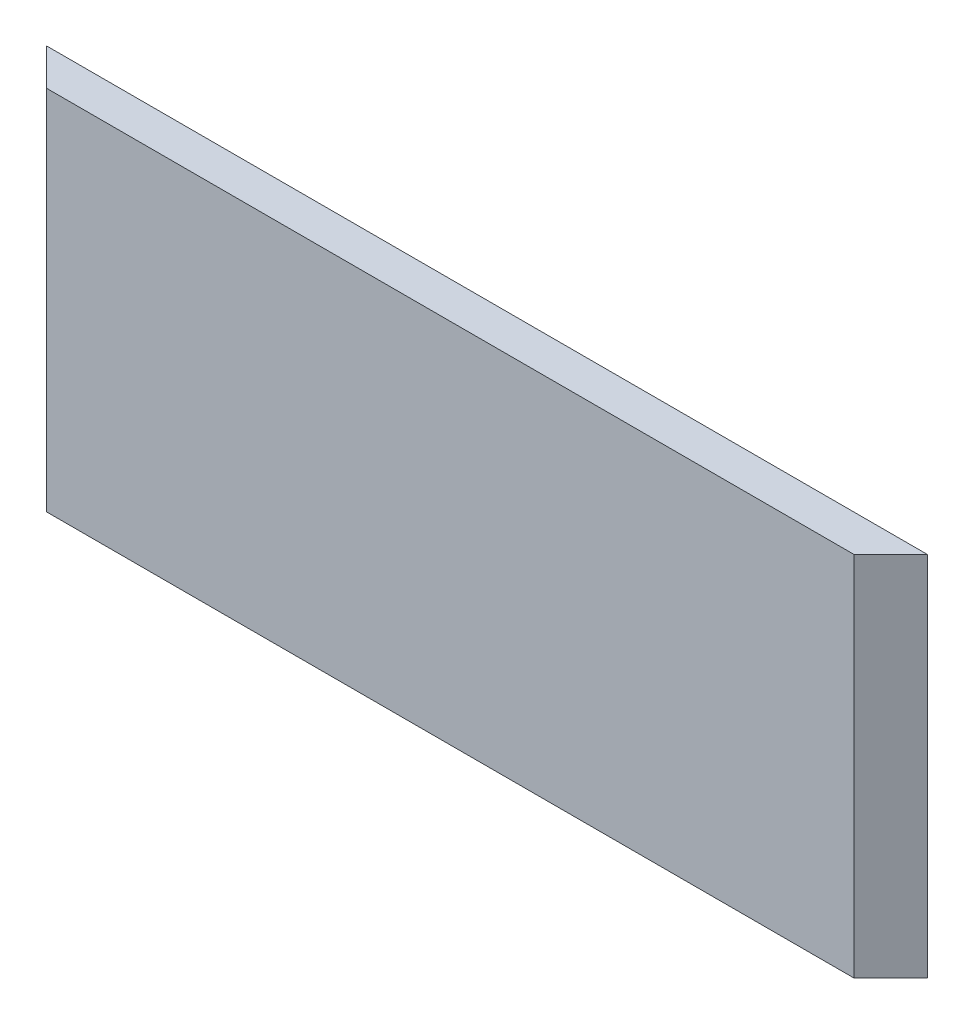
ISO-10303-21;
HEADER;
FILE_DESCRIPTION(('STEP AP214'),'2;1');
FILE_NAME('part.step','',(''),(''),'','','');
FILE_SCHEMA(('AUTOMOTIVE_DESIGN { 1 0 10303 214 1 1 1 1 }'));
ENDSEC;
DATA;
#1=APPLICATION_CONTEXT('core data for automotive mechanical design processes');
#2=APPLICATION_PROTOCOL_DEFINITION('international standard','automotive_design',2000,#1);
#3=PRODUCT_CONTEXT('',#1,'mechanical');
#4=PRODUCT('Part','Part','',(#3));
#5=PRODUCT_RELATED_PRODUCT_CATEGORY('part','',(#4));
#6=PRODUCT_DEFINITION_FORMATION('','',#4);
#7=PRODUCT_DEFINITION_CONTEXT('part definition',#1,'design');
#8=PRODUCT_DEFINITION('design','',#6,#7);
#9=PRODUCT_DEFINITION_SHAPE('','',#8);
#10=(LENGTH_UNIT() NAMED_UNIT(*) SI_UNIT(.MILLI.,.METRE.));
#11=(NAMED_UNIT(*) PLANE_ANGLE_UNIT() SI_UNIT($,.RADIAN.));
#12=(NAMED_UNIT(*) SI_UNIT($,.STERADIAN.) SOLID_ANGLE_UNIT());
#13=UNCERTAINTY_MEASURE_WITH_UNIT(LENGTH_MEASURE(1.E-05),#10,'distance_accuracy_value','');
#14=(GEOMETRIC_REPRESENTATION_CONTEXT(3) GLOBAL_UNCERTAINTY_ASSIGNED_CONTEXT((#13)) GLOBAL_UNIT_ASSIGNED_CONTEXT((#10,
#11,#12)) REPRESENTATION_CONTEXT('',''));
#15=CARTESIAN_POINT('',(0.,0.,0.));
#16=DIRECTION('',(0.,0.,1.));
#17=DIRECTION('',(1.,0.,0.));
#18=AXIS2_PLACEMENT_3D('',#15,#16,#17);
#19=CARTESIAN_POINT('',(0.,0.,5.));
#20=DIRECTION('',(0.,1.,0.));
#21=DIRECTION('',(0.,0.,1.));
#22=AXIS2_PLACEMENT_3D('',#19,#20,#21);
#23=PLANE('',#22);
#24=DIRECTION('',(1.,0.,0.));
#25=VECTOR('',#24,1.);
#26=CARTESIAN_POINT('',(0.,0.,0.));
#27=LINE('',#26,#25);
#28=CARTESIAN_POINT('',(0.,0.,0.));
#29=VERTEX_POINT('',#28);
#30=CARTESIAN_POINT('',(120.,0.,0.));
#31=VERTEX_POINT('',#30);
#32=EDGE_CURVE('E387',#29,#31,#27,.T.);
#33=ORIENTED_EDGE('',*,*,#32,.T.);
#34=DIRECTION('',(0.707106781186547,0.,-0.707106781186548));
#35=VECTOR('',#34,1.);
#36=CARTESIAN_POINT('',(115.,0.,5.));
#37=LINE('',#36,#35);
#38=CARTESIAN_POINT('',(115.,0.,5.00000000000001));
#39=VERTEX_POINT('',#38);
#40=EDGE_CURVE('E11',#31,#39,#37,.F.);
#41=ORIENTED_EDGE('',*,*,#40,.T.);
#42=DIRECTION('',(1.,0.,0.));
#43=VECTOR('',#42,1.);
#44=CARTESIAN_POINT('',(0.,0.,5.));
#45=LINE('',#44,#43);
#46=CARTESIAN_POINT('',(5.,0.,5.));
#47=VERTEX_POINT('',#46);
#48=EDGE_CURVE('E389',#47,#39,#45,.T.);
#49=ORIENTED_EDGE('',*,*,#48,.F.);
#50=DIRECTION('',(0.707106781186546,0.,0.707106781186549));
#51=VECTOR('',#50,1.);
#52=CARTESIAN_POINT('',(5.,0.,5.));
#53=LINE('',#52,#51);
#54=EDGE_CURVE('E385',#47,#29,#53,.F.);
#55=ORIENTED_EDGE('',*,*,#54,.T.);
#56=EDGE_LOOP('',(#33,#41,#49,#55));
#57=FACE_BOUND('',#56,.T.);
#58=ADVANCED_FACE('F349',(#57),#23,.F.);
#59=CARTESIAN_POINT('',(0.,50.,5.));
#60=DIRECTION('',(0.,-1.,0.));
#61=DIRECTION('',(0.,0.,-1.));
#62=AXIS2_PLACEMENT_3D('',#59,#60,#61);
#63=PLANE('',#62);
#64=DIRECTION('',(-1.,0.,0.));
#65=VECTOR('',#64,1.);
#66=CARTESIAN_POINT('',(0.,50.,5.));
#67=LINE('',#66,#65);
#68=CARTESIAN_POINT('',(115.,50.,5.00000000000001));
#69=VERTEX_POINT('',#68);
#70=CARTESIAN_POINT('',(5.,50.,5.));
#71=VERTEX_POINT('',#70);
#72=EDGE_CURVE('E413',#69,#71,#67,.T.);
#73=ORIENTED_EDGE('',*,*,#72,.F.);
#74=DIRECTION('',(-0.707106781186547,0.,0.707106781186548));
#75=VECTOR('',#74,1.);
#76=CARTESIAN_POINT('',(115.,50.,5.));
#77=LINE('',#76,#75);
#78=CARTESIAN_POINT('',(120.,50.,0.));
#79=VERTEX_POINT('',#78);
#80=EDGE_CURVE('E356',#69,#79,#77,.F.);
#81=ORIENTED_EDGE('',*,*,#80,.T.);
#82=DIRECTION('',(-1.,0.,0.));
#83=VECTOR('',#82,1.);
#84=CARTESIAN_POINT('',(0.,50.,0.));
#85=LINE('',#84,#83);
#86=CARTESIAN_POINT('',(0.,50.,0.));
#87=VERTEX_POINT('',#86);
#88=EDGE_CURVE('E410',#79,#87,#85,.T.);
#89=ORIENTED_EDGE('',*,*,#88,.T.);
#90=DIRECTION('',(-0.707106781186546,0.,-0.707106781186549));
#91=VECTOR('',#90,1.);
#92=CARTESIAN_POINT('',(5.,50.,5.));
#93=LINE('',#92,#91);
#94=EDGE_CURVE('E394',#87,#71,#93,.F.);
#95=ORIENTED_EDGE('',*,*,#94,.T.);
#96=EDGE_LOOP('',(#73,#81,#89,#95));
#97=FACE_BOUND('',#96,.T.);
#98=ADVANCED_FACE('F420',(#97),#63,.F.);
#99=CARTESIAN_POINT('',(0.,50.,5.));
#100=DIRECTION('',(0.,0.,-1.));
#101=DIRECTION('',(-1.,0.,0.));
#102=AXIS2_PLACEMENT_3D('',#99,#100,#101);
#103=PLANE('',#102);
#104=ORIENTED_EDGE('',*,*,#48,.T.);
#105=DIRECTION('',(0.,1.,0.));
#106=VECTOR('',#105,1.);
#107=CARTESIAN_POINT('',(115.,50.,5.));
#108=LINE('',#107,#106);
#109=EDGE_CURVE('E417',#39,#69,#108,.T.);
#110=ORIENTED_EDGE('',*,*,#109,.T.);
#111=ORIENTED_EDGE('',*,*,#72,.T.);
#112=DIRECTION('',(0.,-1.,0.));
#113=VECTOR('',#112,1.);
#114=CARTESIAN_POINT('',(5.,50.,5.));
#115=LINE('',#114,#113);
#116=EDGE_CURVE('E395',#71,#47,#115,.T.);
#117=ORIENTED_EDGE('',*,*,#116,.T.);
#118=EDGE_LOOP('',(#104,#110,#111,#117));
#119=FACE_BOUND('',#118,.T.);
#120=ADVANCED_FACE('F423',(#119),#103,.F.);
#121=CARTESIAN_POINT('',(0.,50.,0.));
#122=DIRECTION('',(0.,0.,-1.));
#123=DIRECTION('',(-1.,0.,0.));
#124=AXIS2_PLACEMENT_3D('',#121,#122,#123);
#125=PLANE('',#124);
#126=DIRECTION('',(0.,-1.,0.));
#127=VECTOR('',#126,1.);
#128=CARTESIAN_POINT('',(0.,0.,0.));
#129=LINE('',#128,#127);
#130=EDGE_CURVE('E401',#87,#29,#129,.T.);
#131=ORIENTED_EDGE('',*,*,#130,.F.);
#132=ORIENTED_EDGE('',*,*,#88,.F.);
#133=DIRECTION('',(0.,1.,0.));
#134=VECTOR('',#133,1.);
#135=CARTESIAN_POINT('',(120.,0.,0.));
#136=LINE('',#135,#134);
#137=EDGE_CURVE('E403',#31,#79,#136,.T.);
#138=ORIENTED_EDGE('',*,*,#137,.F.);
#139=ORIENTED_EDGE('',*,*,#32,.F.);
#140=EDGE_LOOP('',(#131,#132,#138,#139));
#141=FACE_BOUND('',#140,.T.);
#142=ADVANCED_FACE('F399',(#141),#125,.T.);
#143=CARTESIAN_POINT('',(5.,50.,5.));
#144=DIRECTION('',(0.707106781186549,0.,-0.707106781186546));
#145=DIRECTION('',(-0.707106781186546,0.,-0.707106781186549));
#146=AXIS2_PLACEMENT_3D('',#143,#144,#145);
#147=PLANE('',#146);
#148=ORIENTED_EDGE('',*,*,#94,.F.);
#149=ORIENTED_EDGE('',*,*,#130,.T.);
#150=ORIENTED_EDGE('',*,*,#54,.F.);
#151=ORIENTED_EDGE('',*,*,#116,.F.);
#152=EDGE_LOOP('',(#148,#149,#150,#151));
#153=FACE_BOUND('',#152,.T.);
#154=ADVANCED_FACE('F405',(#153),#147,.F.);
#155=CARTESIAN_POINT('',(115.,50.,5.));
#156=DIRECTION('',(-0.707106781186548,0.,-0.707106781186547));
#157=DIRECTION('',(-0.707106781186547,0.,0.707106781186548));
#158=AXIS2_PLACEMENT_3D('',#155,#156,#157);
#159=PLANE('',#158);
#160=ORIENTED_EDGE('',*,*,#40,.F.);
#161=ORIENTED_EDGE('',*,*,#137,.T.);
#162=ORIENTED_EDGE('',*,*,#80,.F.);
#163=ORIENTED_EDGE('',*,*,#109,.F.);
#164=EDGE_LOOP('',(#160,#161,#162,#163));
#165=FACE_BOUND('',#164,.T.);
#166=ADVANCED_FACE('F421',(#165),#159,.F.);
#167=CLOSED_SHELL('',(#58,#98,#120,#142,#154,#166));
#168=MANIFOLD_SOLID_BREP('B2',#167);
#169=ADVANCED_BREP_SHAPE_REPRESENTATION('',(#18,#168),#14);
#170=SHAPE_DEFINITION_REPRESENTATION(#9,#169);
ENDSEC;
END-ISO-10303-21;
